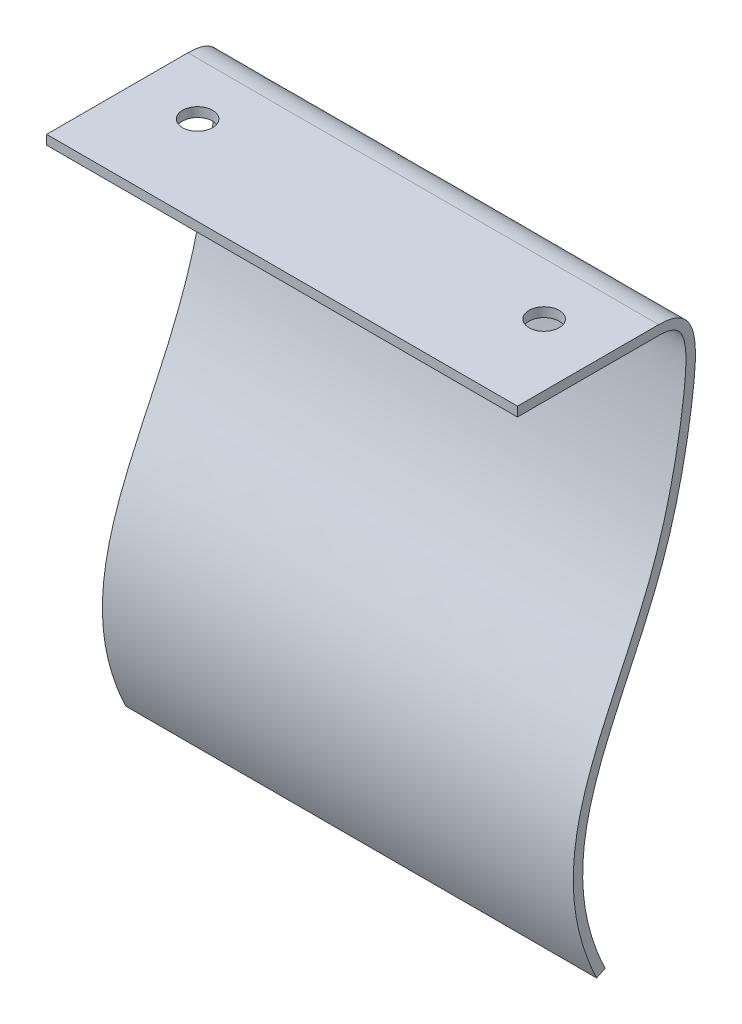
ISO-10303-21;
HEADER;
FILE_DESCRIPTION(('STEP AP214'),'2;1');
FILE_NAME('part.step','',(''),(''),'','','');
FILE_SCHEMA(('AUTOMOTIVE_DESIGN { 1 0 10303 214 1 1 1 1 }'));
ENDSEC;
DATA;
#1=APPLICATION_CONTEXT('core data for automotive mechanical design processes');
#2=APPLICATION_PROTOCOL_DEFINITION('international standard','automotive_design',2000,#1);
#3=PRODUCT_CONTEXT('',#1,'mechanical');
#4=PRODUCT('Part','Part','',(#3));
#5=PRODUCT_RELATED_PRODUCT_CATEGORY('part','',(#4));
#6=PRODUCT_DEFINITION_FORMATION('','',#4);
#7=PRODUCT_DEFINITION_CONTEXT('part definition',#1,'design');
#8=PRODUCT_DEFINITION('design','',#6,#7);
#9=PRODUCT_DEFINITION_SHAPE('','',#8);
#10=(LENGTH_UNIT() NAMED_UNIT(*) SI_UNIT(.MILLI.,.METRE.));
#11=(NAMED_UNIT(*) PLANE_ANGLE_UNIT() SI_UNIT($,.RADIAN.));
#12=(NAMED_UNIT(*) SI_UNIT($,.STERADIAN.) SOLID_ANGLE_UNIT());
#13=UNCERTAINTY_MEASURE_WITH_UNIT(LENGTH_MEASURE(1.E-05),#10,'distance_accuracy_value','');
#14=(GEOMETRIC_REPRESENTATION_CONTEXT(3) GLOBAL_UNCERTAINTY_ASSIGNED_CONTEXT((#13)) GLOBAL_UNIT_ASSIGNED_CONTEXT((#10,
#11,#12)) REPRESENTATION_CONTEXT('',''));
#15=CARTESIAN_POINT('',(0.,0.,0.));
#16=DIRECTION('',(0.,0.,1.));
#17=DIRECTION('',(1.,0.,0.));
#18=AXIS2_PLACEMENT_3D('',#15,#16,#17);
#19=CARTESIAN_POINT('',(50.,-1.,-15.));
#20=CARTESIAN_POINT('',(50.,-1.,-15.4747001295405));
#21=CARTESIAN_POINT('',(50.,-1.05158999845612,-15.8618260323861));
#22=CARTESIAN_POINT('',(50.,-1.22098566689809,-16.4808552917127));
#23=CARTESIAN_POINT('',(50.,-1.33605394139005,-16.7125500561632));
#24=CARTESIAN_POINT('',(50.,-1.61345374059868,-17.089368536639));
#25=CARTESIAN_POINT('',(50.,-1.77767427992872,-17.2387277927181));
#26=CARTESIAN_POINT('',(50.,-2.20458194492222,-17.5016554181683));
#27=CARTESIAN_POINT('',(50.,-2.46939069835437,-17.6127693352164));
#28=CARTESIAN_POINT('',(50.,-3.11562501304447,-17.7833740912657));
#29=CARTESIAN_POINT('',(50.,-3.49567906710736,-17.8419763022667));
#30=CARTESIAN_POINT('',(50.,-4.35435500926627,-17.9025052917038));
#31=CARTESIAN_POINT('',(50.,-4.83256318093579,-17.9047049943545));
#32=CARTESIAN_POINT('',(50.,-5.86953685876028,-17.8614627746531));
#33=CARTESIAN_POINT('',(50.,-6.4282966759477,-17.8161861667887));
#34=CARTESIAN_POINT('',(50.,-7.61229387525329,-17.6915867480213));
#35=CARTESIAN_POINT('',(50.,-8.23895583761045,-17.6129951945635));
#36=CARTESIAN_POINT('',(50.,-11.4830311742176,-17.1639327479736));
#37=CARTESIAN_POINT('',(50.,-14.4421496704646,-16.6065410245806));
#38=CARTESIAN_POINT('',(50.,-18.0503242083341,-15.6544918248672));
#39=CARTESIAN_POINT('',(50.,-18.7674197368904,-15.4513557269849));
#40=CARTESIAN_POINT('',(50.,-20.1787682935508,-15.0196863470576));
#41=CARTESIAN_POINT('',(50.,-20.8713555683902,-14.7909478714816));
#42=CARTESIAN_POINT('',(50.,-22.914211322163,-14.0674929098942));
#43=CARTESIAN_POINT('',(50.,-24.230859394377,-13.5377192242824));
#44=CARTESIAN_POINT('',(50.,-28.0846351077296,-11.877778676627));
#45=CARTESIAN_POINT('',(50.,-30.5251261075091,-10.6762442620859));
#46=CARTESIAN_POINT('',(50.,-35.3620658447384,-8.48074521822651));
#47=CARTESIAN_POINT('',(50.,-37.759496577708,-7.48582634415419));
#48=CARTESIAN_POINT('',(50.,-42.7297575154396,-6.13478268432517));
#49=CARTESIAN_POINT('',(50.,-45.3058431092896,-5.7819166262027));
#50=CARTESIAN_POINT('',(50.,-50.7827689802633,-6.17661316584914));
#51=CARTESIAN_POINT('',(50.,-53.6758070880797,-6.92456696500553));
#52=CARTESIAN_POINT('',(50.,-56.7936731309467,-8.40515267022872));
#53=B_SPLINE_CURVE_WITH_KNOTS('',3,(#19,#20,#21,#22,#23,#24,#25,#26,#27,#28,#29,#30,#31,#32,#33,
#34,#35,#36,#37,#38,#39,#40,#41,#42,#43,#44,#45,#46,#47,#48,#49,#50,#51,#52),.UNSPECIFIED.,.F.,
.F.,(4,2,2,2,2,2,2,2,2,2,2,2,2,2,2,2,4),(0.,0.0312499999999999,0.0624999999999998,
0.0937499999999997,0.125,0.15625,0.187499999999999,0.218749999999999,0.249999999999999,
0.374999999999999,0.406249999999999,0.437499999999999,0.499999999999999,0.624999999999999,
0.749999999999999,0.875,1.),.UNSPECIFIED.);
#54=DIRECTION('',(-1.,0.,0.));
#55=VECTOR('',#54,1.);
#56=SURFACE_OF_LINEAR_EXTRUSION('',#53,#55);
#57=CARTESIAN_POINT('',(0.,-1.,-15.));
#58=CARTESIAN_POINT('',(0.,-1.,-15.4747001295405));
#59=CARTESIAN_POINT('',(0.,-1.05158999845612,-15.8618260323861));
#60=CARTESIAN_POINT('',(0.,-1.22098566689809,-16.4808552917127));
#61=CARTESIAN_POINT('',(0.,-1.33605394139005,-16.7125500561632));
#62=CARTESIAN_POINT('',(0.,-1.61345374059868,-17.089368536639));
#63=CARTESIAN_POINT('',(0.,-1.77767427992872,-17.2387277927181));
#64=CARTESIAN_POINT('',(0.,-2.20458194492222,-17.5016554181683));
#65=CARTESIAN_POINT('',(0.,-2.46939069835437,-17.6127693352164));
#66=CARTESIAN_POINT('',(0.,-3.11562501304447,-17.7833740912657));
#67=CARTESIAN_POINT('',(0.,-3.49567906710736,-17.8419763022667));
#68=CARTESIAN_POINT('',(0.,-4.35435500926627,-17.9025052917038));
#69=CARTESIAN_POINT('',(0.,-4.83256318093579,-17.9047049943545));
#70=CARTESIAN_POINT('',(0.,-5.86953685876028,-17.8614627746531));
#71=CARTESIAN_POINT('',(0.,-6.4282966759477,-17.8161861667887));
#72=CARTESIAN_POINT('',(0.,-7.61229387525329,-17.6915867480213));
#73=CARTESIAN_POINT('',(0.,-8.23895583761045,-17.6129951945635));
#74=CARTESIAN_POINT('',(0.,-11.4830311742176,-17.1639327479736));
#75=CARTESIAN_POINT('',(0.,-14.4421496704646,-16.6065410245806));
#76=CARTESIAN_POINT('',(0.,-18.0503242083341,-15.6544918248672));
#77=CARTESIAN_POINT('',(0.,-18.7674197368904,-15.4513557269849));
#78=CARTESIAN_POINT('',(0.,-20.1787682935508,-15.0196863470576));
#79=CARTESIAN_POINT('',(0.,-20.8713555683902,-14.7909478714816));
#80=CARTESIAN_POINT('',(0.,-22.914211322163,-14.0674929098942));
#81=CARTESIAN_POINT('',(0.,-24.230859394377,-13.5377192242824));
#82=CARTESIAN_POINT('',(0.,-28.0846351077296,-11.877778676627));
#83=CARTESIAN_POINT('',(0.,-30.5251261075091,-10.6762442620859));
#84=CARTESIAN_POINT('',(0.,-35.3620658447384,-8.48074521822651));
#85=CARTESIAN_POINT('',(0.,-37.759496577708,-7.48582634415419));
#86=CARTESIAN_POINT('',(0.,-42.7297575154396,-6.13478268432517));
#87=CARTESIAN_POINT('',(0.,-45.3058431092896,-5.7819166262027));
#88=CARTESIAN_POINT('',(0.,-50.7827689802633,-6.17661316584914));
#89=CARTESIAN_POINT('',(0.,-53.6758070880797,-6.92456696500553));
#90=CARTESIAN_POINT('',(0.,-56.7936731309467,-8.40515267022872));
#91=B_SPLINE_CURVE_WITH_KNOTS('',3,(#57,#58,#59,#60,#61,#62,#63,#64,#65,#66,#67,#68,#69,#70,#71,
#72,#73,#74,#75,#76,#77,#78,#79,#80,#81,#82,#83,#84,#85,#86,#87,#88,#89,#90),.UNSPECIFIED.,.F.,
.F.,(4,2,2,2,2,2,2,2,2,2,2,2,2,2,2,2,4),(0.,0.0312499999999999,0.0624999999999998,
0.0937499999999997,0.125,0.15625,0.187499999999999,0.218749999999999,0.249999999999999,
0.374999999999999,0.406249999999999,0.437499999999999,0.499999999999999,0.624999999999999,
0.749999999999999,0.875,1.),.UNSPECIFIED.);
#92=CARTESIAN_POINT('',(0.,-1.,-15.));
#93=VERTEX_POINT('',#92);
#94=CARTESIAN_POINT('',(0.,-56.7936731309467,-8.40515267022872));
#95=VERTEX_POINT('',#94);
#96=EDGE_CURVE('E123',#93,#95,#91,.T.);
#97=ORIENTED_EDGE('',*,*,#96,.T.);
#98=DIRECTION('',(-1.,0.,0.));
#99=VECTOR('',#98,1.);
#100=CARTESIAN_POINT('',(50.,-56.7936731309467,-8.40515267022872));
#101=LINE('',#100,#99);
#102=CARTESIAN_POINT('',(50.,-56.7936731309467,-8.40515267022872));
#103=VERTEX_POINT('',#102);
#104=EDGE_CURVE('E11',#103,#95,#101,.T.);
#105=ORIENTED_EDGE('',*,*,#104,.F.);
#106=CARTESIAN_POINT('',(50.,-1.,-15.));
#107=VERTEX_POINT('',#106);
#108=EDGE_CURVE('E88',#107,#103,#53,.T.);
#109=ORIENTED_EDGE('',*,*,#108,.F.);
#110=DIRECTION('',(-1.,0.,0.));
#111=VECTOR('',#110,1.);
#112=CARTESIAN_POINT('',(50.,-1.,-15.));
#113=LINE('',#112,#111);
#114=EDGE_CURVE('E119',#107,#93,#113,.T.);
#115=ORIENTED_EDGE('',*,*,#114,.T.);
#116=EDGE_LOOP('',(#97,#105,#109,#115));
#117=FACE_BOUND('',#116,.T.);
#118=ADVANCED_FACE('F41',(#117),#56,.F.);
#119=CARTESIAN_POINT('',(50.,-56.3647110316765,-9.30847515826373));
#120=DIRECTION('',(0.,-0.903322488035007,-0.428962099270138));
#121=DIRECTION('',(0.,0.428962099270139,-0.903322488035007));
#122=AXIS2_PLACEMENT_3D('',#119,#120,#121);
#123=PLANE('',#122);
#124=DIRECTION('',(0.,-0.428962099270138,0.903322488035007));
#125=VECTOR('',#124,1.);
#126=CARTESIAN_POINT('',(0.,-56.3647110316765,-9.30847515826373));
#127=LINE('',#126,#125);
#128=CARTESIAN_POINT('',(0.,-56.3647110316765,-9.30847515826373));
#129=VERTEX_POINT('',#128);
#130=EDGE_CURVE('E128',#129,#95,#127,.T.);
#131=ORIENTED_EDGE('',*,*,#130,.F.);
#132=DIRECTION('',(-1.,0.,0.));
#133=VECTOR('',#132,1.);
#134=CARTESIAN_POINT('',(50.,-56.3647110316765,-9.30847515826373));
#135=LINE('',#134,#133);
#136=CARTESIAN_POINT('',(50.,-56.3647110316765,-9.30847515826373));
#137=VERTEX_POINT('',#136);
#138=EDGE_CURVE('E50',#137,#129,#135,.T.);
#139=ORIENTED_EDGE('',*,*,#138,.F.);
#140=DIRECTION('',(0.,-0.428962099270138,0.903322488035007));
#141=VECTOR('',#140,1.);
#142=CARTESIAN_POINT('',(50.,-56.3647110316765,-9.30847515826373));
#143=LINE('',#142,#141);
#144=EDGE_CURVE('E186',#137,#103,#143,.T.);
#145=ORIENTED_EDGE('',*,*,#144,.T.);
#146=ORIENTED_EDGE('',*,*,#104,.T.);
#147=EDGE_LOOP('',(#131,#139,#145,#146));
#148=FACE_BOUND('',#147,.T.);
#149=ADVANCED_FACE('F155',(#148),#123,.T.);
#150=CARTESIAN_POINT('',(50.,0.,-15.));
#151=CARTESIAN_POINT('',(50.,0.,-19.1309384430358));
#152=CARTESIAN_POINT('',(50.,-5.97784772407404,-19.3122204090287));
#153=CARTESIAN_POINT('',(50.,-31.179131786987,-14.4064606671218));
#154=CARTESIAN_POINT('',(50.,-42.3720806432589,-2.66377386362031));
#155=CARTESIAN_POINT('',(50.,-56.3647110316765,-9.30847515826373));
#156=B_SPLINE_CURVE_WITH_KNOTS('',3,(#150,#151,#152,#153,#154,#155),.UNSPECIFIED.,.F.,.F.,(4,1,
1,4),(0.,0.236283029465971,0.420799841596301,1.),.UNSPECIFIED.);
#157=DIRECTION('',(-1.,0.,0.));
#158=VECTOR('',#157,1.);
#159=SURFACE_OF_LINEAR_EXTRUSION('',#156,#158);
#160=CARTESIAN_POINT('',(0.,0.,-15.));
#161=CARTESIAN_POINT('',(0.,0.,-19.1309384430358));
#162=CARTESIAN_POINT('',(0.,-5.97784772407404,-19.3122204090287));
#163=CARTESIAN_POINT('',(0.,-31.179131786987,-14.4064606671218));
#164=CARTESIAN_POINT('',(0.,-42.3720806432589,-2.66377386362031));
#165=CARTESIAN_POINT('',(0.,-56.3647110316765,-9.30847515826373));
#166=B_SPLINE_CURVE_WITH_KNOTS('',3,(#160,#161,#162,#163,#164,#165),.UNSPECIFIED.,.F.,.F.,(4,1,
1,4),(0.,0.236283029465971,0.420799841596301,1.),.UNSPECIFIED.);
#167=CARTESIAN_POINT('',(0.,0.,-15.));
#168=VERTEX_POINT('',#167);
#169=EDGE_CURVE('E135',#168,#129,#166,.T.);
#170=ORIENTED_EDGE('',*,*,#169,.F.);
#171=DIRECTION('',(-1.,0.,0.));
#172=VECTOR('',#171,1.);
#173=CARTESIAN_POINT('',(50.,0.,-15.));
#174=LINE('',#173,#172);
#175=CARTESIAN_POINT('',(50.,0.,-15.));
#176=VERTEX_POINT('',#175);
#177=EDGE_CURVE('E109',#176,#168,#174,.T.);
#178=ORIENTED_EDGE('',*,*,#177,.F.);
#179=EDGE_CURVE('E115',#176,#137,#156,.T.);
#180=ORIENTED_EDGE('',*,*,#179,.T.);
#181=ORIENTED_EDGE('',*,*,#138,.T.);
#182=EDGE_LOOP('',(#170,#178,#180,#181));
#183=FACE_BOUND('',#182,.T.);
#184=ADVANCED_FACE('F152',(#183),#159,.T.);
#185=CARTESIAN_POINT('',(50.,0.,0.));
#186=DIRECTION('',(0.,1.,0.));
#187=DIRECTION('',(0.,0.,1.));
#188=AXIS2_PLACEMENT_3D('',#185,#186,#187);
#189=PLANE('',#188);
#190=CARTESIAN_POINT('',(43.4,0.,-9.42836152683668));
#191=DIRECTION('',(0.,1.,0.));
#192=DIRECTION('',(0.,0.,1.));
#193=AXIS2_PLACEMENT_3D('',#190,#191,#192);
#194=CIRCLE('',#193,1.6);
#195=CARTESIAN_POINT('',(43.4,0.,-7.82836152683668));
#196=VERTEX_POINT('',#195);
#197=EDGE_CURVE('E202',#196,#196,#194,.T.);
#198=ORIENTED_EDGE('',*,*,#197,.F.);
#199=EDGE_LOOP('',(#198));
#200=FACE_BOUND('',#199,.T.);
#201=CARTESIAN_POINT('',(6.6,0.,-9.42836152683668));
#202=DIRECTION('',(0.,1.,0.));
#203=DIRECTION('',(0.,0.,1.));
#204=AXIS2_PLACEMENT_3D('',#201,#202,#203);
#205=CIRCLE('',#204,1.6);
#206=CARTESIAN_POINT('',(6.6,0.,-7.82836152683668));
#207=VERTEX_POINT('',#206);
#208=EDGE_CURVE('E129',#207,#207,#205,.T.);
#209=ORIENTED_EDGE('',*,*,#208,.F.);
#210=EDGE_LOOP('',(#209));
#211=FACE_BOUND('',#210,.T.);
#212=DIRECTION('',(0.,0.,-1.));
#213=VECTOR('',#212,1.);
#214=CARTESIAN_POINT('',(0.,0.,0.));
#215=LINE('',#214,#213);
#216=CARTESIAN_POINT('',(0.,0.,0.));
#217=VERTEX_POINT('',#216);
#218=EDGE_CURVE('E104',#217,#168,#215,.T.);
#219=ORIENTED_EDGE('',*,*,#218,.F.);
#220=DIRECTION('',(-1.,0.,0.));
#221=VECTOR('',#220,1.);
#222=CARTESIAN_POINT('',(50.,0.,0.));
#223=LINE('',#222,#221);
#224=CARTESIAN_POINT('',(50.,0.,0.));
#225=VERTEX_POINT('',#224);
#226=EDGE_CURVE('E99',#225,#217,#223,.T.);
#227=ORIENTED_EDGE('',*,*,#226,.F.);
#228=DIRECTION('',(0.,0.,-1.));
#229=VECTOR('',#228,1.);
#230=CARTESIAN_POINT('',(50.,0.,0.));
#231=LINE('',#230,#229);
#232=EDGE_CURVE('E102',#225,#176,#231,.T.);
#233=ORIENTED_EDGE('',*,*,#232,.T.);
#234=ORIENTED_EDGE('',*,*,#177,.T.);
#235=EDGE_LOOP('',(#219,#227,#233,#234));
#236=FACE_BOUND('',#235,.T.);
#237=ADVANCED_FACE('F101',(#200,#211,#236),#189,.T.);
#238=CARTESIAN_POINT('',(50.,-1.,0.));
#239=DIRECTION('',(0.,0.,1.));
#240=DIRECTION('',(1.,0.,0.));
#241=AXIS2_PLACEMENT_3D('',#238,#239,#240);
#242=PLANE('',#241);
#243=DIRECTION('',(0.,1.,0.));
#244=VECTOR('',#243,1.);
#245=CARTESIAN_POINT('',(0.,-1.,0.));
#246=LINE('',#245,#244);
#247=CARTESIAN_POINT('',(0.,-1.,0.));
#248=VERTEX_POINT('',#247);
#249=EDGE_CURVE('E144',#248,#217,#246,.T.);
#250=ORIENTED_EDGE('',*,*,#249,.F.);
#251=DIRECTION('',(-1.,0.,0.));
#252=VECTOR('',#251,1.);
#253=CARTESIAN_POINT('',(50.,-1.,0.));
#254=LINE('',#253,#252);
#255=CARTESIAN_POINT('',(50.,-1.,0.));
#256=VERTEX_POINT('',#255);
#257=EDGE_CURVE('E79',#256,#248,#254,.T.);
#258=ORIENTED_EDGE('',*,*,#257,.F.);
#259=DIRECTION('',(0.,1.,0.));
#260=VECTOR('',#259,1.);
#261=CARTESIAN_POINT('',(50.,-1.,0.));
#262=LINE('',#261,#260);
#263=EDGE_CURVE('E113',#256,#225,#262,.T.);
#264=ORIENTED_EDGE('',*,*,#263,.T.);
#265=ORIENTED_EDGE('',*,*,#226,.T.);
#266=EDGE_LOOP('',(#250,#258,#264,#265));
#267=FACE_BOUND('',#266,.T.);
#268=ADVANCED_FACE('F117',(#267),#242,.T.);
#269=CARTESIAN_POINT('',(50.,-1.,0.));
#270=DIRECTION('',(0.,1.,0.));
#271=DIRECTION('',(0.,0.,1.));
#272=AXIS2_PLACEMENT_3D('',#269,#270,#271);
#273=PLANE('',#272);
#274=CARTESIAN_POINT('',(43.4,-1.,-9.42836152683668));
#275=DIRECTION('',(0.,1.,0.));
#276=DIRECTION('',(0.,0.,1.));
#277=AXIS2_PLACEMENT_3D('',#274,#275,#276);
#278=CIRCLE('',#277,1.6);
#279=CARTESIAN_POINT('',(43.4,-1.,-7.82836152683668));
#280=VERTEX_POINT('',#279);
#281=EDGE_CURVE('E205',#280,#280,#278,.F.);
#282=ORIENTED_EDGE('',*,*,#281,.F.);
#283=EDGE_LOOP('',(#282));
#284=FACE_BOUND('',#283,.T.);
#285=CARTESIAN_POINT('',(6.6,-1.,-9.42836152683668));
#286=DIRECTION('',(0.,1.,0.));
#287=DIRECTION('',(0.,0.,1.));
#288=AXIS2_PLACEMENT_3D('',#285,#286,#287);
#289=CIRCLE('',#288,1.6);
#290=CARTESIAN_POINT('',(6.6,-1.,-7.82836152683668));
#291=VERTEX_POINT('',#290);
#292=EDGE_CURVE('E199',#291,#291,#289,.F.);
#293=ORIENTED_EDGE('',*,*,#292,.F.);
#294=EDGE_LOOP('',(#293));
#295=FACE_BOUND('',#294,.T.);
#296=DIRECTION('',(0.,0.,-1.));
#297=VECTOR('',#296,1.);
#298=CARTESIAN_POINT('',(0.,-1.,0.));
#299=LINE('',#298,#297);
#300=EDGE_CURVE('E82',#248,#93,#299,.T.);
#301=ORIENTED_EDGE('',*,*,#300,.T.);
#302=ORIENTED_EDGE('',*,*,#114,.F.);
#303=DIRECTION('',(0.,0.,-1.));
#304=VECTOR('',#303,1.);
#305=CARTESIAN_POINT('',(50.,-1.,0.));
#306=LINE('',#305,#304);
#307=EDGE_CURVE('E58',#256,#107,#306,.T.);
#308=ORIENTED_EDGE('',*,*,#307,.F.);
#309=ORIENTED_EDGE('',*,*,#257,.T.);
#310=EDGE_LOOP('',(#301,#302,#308,#309));
#311=FACE_BOUND('',#310,.T.);
#312=ADVANCED_FACE('F160',(#284,#295,#311),#273,.F.);
#313=CARTESIAN_POINT('',(50.,-25.5154512988279,-12.9844057083973));
#314=DIRECTION('',(1.,0.,0.));
#315=DIRECTION('',(0.,0.,-1.));
#316=AXIS2_PLACEMENT_3D('',#313,#314,#315);
#317=PLANE('',#316);
#318=ORIENTED_EDGE('',*,*,#108,.T.);
#319=ORIENTED_EDGE('',*,*,#144,.F.);
#320=ORIENTED_EDGE('',*,*,#179,.F.);
#321=ORIENTED_EDGE('',*,*,#232,.F.);
#322=ORIENTED_EDGE('',*,*,#263,.F.);
#323=ORIENTED_EDGE('',*,*,#307,.T.);
#324=EDGE_LOOP('',(#318,#319,#320,#321,#322,#323));
#325=FACE_BOUND('',#324,.T.);
#326=ADVANCED_FACE('F112',(#325),#317,.T.);
#327=CARTESIAN_POINT('',(0.,-25.5154512988279,-12.9844057083973));
#328=DIRECTION('',(1.,0.,0.));
#329=DIRECTION('',(0.,0.,-1.));
#330=AXIS2_PLACEMENT_3D('',#327,#328,#329);
#331=PLANE('',#330);
#332=ORIENTED_EDGE('',*,*,#96,.F.);
#333=ORIENTED_EDGE('',*,*,#300,.F.);
#334=ORIENTED_EDGE('',*,*,#249,.T.);
#335=ORIENTED_EDGE('',*,*,#218,.T.);
#336=ORIENTED_EDGE('',*,*,#169,.T.);
#337=ORIENTED_EDGE('',*,*,#130,.T.);
#338=EDGE_LOOP('',(#332,#333,#334,#335,#336,#337));
#339=FACE_BOUND('',#338,.T.);
#340=ADVANCED_FACE('F158',(#339),#331,.F.);
#341=CARTESIAN_POINT('',(6.6,-56.7946731309467,-9.42836152683668));
#342=DIRECTION('',(0.,1.,0.));
#343=DIRECTION('',(0.,0.,1.));
#344=AXIS2_PLACEMENT_3D('',#341,#342,#343);
#345=CYLINDRICAL_SURFACE('',#344,1.6);
#346=ORIENTED_EDGE('',*,*,#208,.T.);
#347=EDGE_LOOP('',(#346));
#348=FACE_BOUND('',#347,.T.);
#349=ORIENTED_EDGE('',*,*,#292,.T.);
#350=EDGE_LOOP('',(#349));
#351=FACE_BOUND('',#350,.T.);
#352=ADVANCED_FACE('F210',(#348,#351),#345,.F.);
#353=CARTESIAN_POINT('',(43.4,-56.7946731309467,-9.42836152683668));
#354=DIRECTION('',(0.,1.,0.));
#355=DIRECTION('',(0.,0.,1.));
#356=AXIS2_PLACEMENT_3D('',#353,#354,#355);
#357=CYLINDRICAL_SURFACE('',#356,1.6);
#358=ORIENTED_EDGE('',*,*,#197,.T.);
#359=EDGE_LOOP('',(#358));
#360=FACE_BOUND('',#359,.T.);
#361=ORIENTED_EDGE('',*,*,#281,.T.);
#362=EDGE_LOOP('',(#361));
#363=FACE_BOUND('',#362,.T.);
#364=ADVANCED_FACE('F208',(#360,#363),#357,.F.);
#365=CLOSED_SHELL('',(#118,#149,#184,#237,#268,#312,#326,#340,#352,#364));
#366=MANIFOLD_SOLID_BREP('B2',#365);
#367=ADVANCED_BREP_SHAPE_REPRESENTATION('',(#18,#366),#14);
#368=SHAPE_DEFINITION_REPRESENTATION(#9,#367);
ENDSEC;
END-ISO-10303-21;
